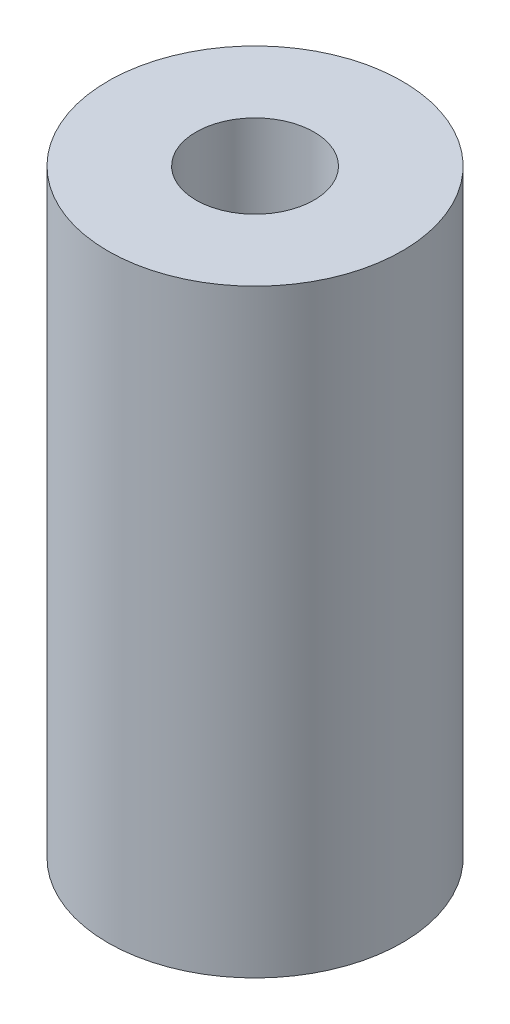
ISO-10303-21;
HEADER;
FILE_DESCRIPTION(('STEP AP214'),'2;1');
FILE_NAME('part.step','',(''),(''),'','','');
FILE_SCHEMA(('AUTOMOTIVE_DESIGN { 1 0 10303 214 1 1 1 1 }'));
ENDSEC;
DATA;
#1=APPLICATION_CONTEXT('core data for automotive mechanical design processes');
#2=APPLICATION_PROTOCOL_DEFINITION('international standard','automotive_design',2000,#1);
#3=PRODUCT_CONTEXT('',#1,'mechanical');
#4=PRODUCT('Part','Part','',(#3));
#5=PRODUCT_RELATED_PRODUCT_CATEGORY('part','',(#4));
#6=PRODUCT_DEFINITION_FORMATION('','',#4);
#7=PRODUCT_DEFINITION_CONTEXT('part definition',#1,'design');
#8=PRODUCT_DEFINITION('design','',#6,#7);
#9=PRODUCT_DEFINITION_SHAPE('','',#8);
#10=(LENGTH_UNIT() NAMED_UNIT(*) SI_UNIT(.MILLI.,.METRE.));
#11=(NAMED_UNIT(*) PLANE_ANGLE_UNIT() SI_UNIT($,.RADIAN.));
#12=(NAMED_UNIT(*) SI_UNIT($,.STERADIAN.) SOLID_ANGLE_UNIT());
#13=UNCERTAINTY_MEASURE_WITH_UNIT(LENGTH_MEASURE(1.E-05),#10,'distance_accuracy_value','');
#14=(GEOMETRIC_REPRESENTATION_CONTEXT(3) GLOBAL_UNCERTAINTY_ASSIGNED_CONTEXT((#13)) GLOBAL_UNIT_ASSIGNED_CONTEXT((#10,
#11,#12)) REPRESENTATION_CONTEXT('',''));
#15=CARTESIAN_POINT('',(0.,0.,0.));
#16=DIRECTION('',(0.,0.,1.));
#17=DIRECTION('',(1.,0.,0.));
#18=AXIS2_PLACEMENT_3D('',#15,#16,#17);
#19=CARTESIAN_POINT('',(0.,34.,0.));
#20=DIRECTION('',(0.,-1.,0.));
#21=DIRECTION('',(0.,0.,-1.));
#22=AXIS2_PLACEMENT_3D('',#19,#20,#21);
#23=CYLINDRICAL_SURFACE('',#22,3.35);
#24=CARTESIAN_POINT('',(0.,15.5,0.));
#25=DIRECTION('',(0.,1.,0.));
#26=DIRECTION('',(0.,0.,1.));
#27=AXIS2_PLACEMENT_3D('',#24,#25,#26);
#28=CIRCLE('',#27,3.35);
#29=CARTESIAN_POINT('',(0.,15.5,3.35));
#30=VERTEX_POINT('',#29);
#31=EDGE_CURVE('E53',#30,#30,#28,.T.);
#32=ORIENTED_EDGE('',*,*,#31,.T.);
#33=EDGE_LOOP('',(#32));
#34=FACE_BOUND('',#33,.T.);
#35=CARTESIAN_POINT('',(0.,0.,0.));
#36=DIRECTION('',(0.,1.,0.));
#37=DIRECTION('',(0.,0.,1.));
#38=AXIS2_PLACEMENT_3D('',#35,#36,#37);
#39=CIRCLE('',#38,3.35);
#40=CARTESIAN_POINT('',(0.,0.,3.35));
#41=VERTEX_POINT('',#40);
#42=EDGE_CURVE('E67',#41,#41,#39,.T.);
#43=ORIENTED_EDGE('',*,*,#42,.F.);
#44=EDGE_LOOP('',(#43));
#45=FACE_BOUND('',#44,.T.);
#46=ADVANCED_FACE('F45',(#34,#45),#23,.F.);
#47=CARTESIAN_POINT('',(0.,34.,0.));
#48=DIRECTION('',(0.,1.,0.));
#49=DIRECTION('',(0.,0.,1.));
#50=AXIS2_PLACEMENT_3D('',#47,#48,#49);
#51=PLANE('',#50);
#52=CARTESIAN_POINT('',(0.,34.,0.));
#53=DIRECTION('',(0.,1.,0.));
#54=DIRECTION('',(0.,0.,1.));
#55=AXIS2_PLACEMENT_3D('',#52,#53,#54);
#56=CIRCLE('',#55,8.35);
#57=CARTESIAN_POINT('',(0.,34.,8.35));
#58=VERTEX_POINT('',#57);
#59=EDGE_CURVE('E57',#58,#58,#56,.T.);
#60=ORIENTED_EDGE('',*,*,#59,.T.);
#61=EDGE_LOOP('',(#60));
#62=FACE_BOUND('',#61,.T.);
#63=CARTESIAN_POINT('',(0.,34.,0.));
#64=DIRECTION('',(0.,1.,0.));
#65=DIRECTION('',(0.,0.,1.));
#66=AXIS2_PLACEMENT_3D('',#63,#64,#65);
#67=CIRCLE('',#66,3.35);
#68=CARTESIAN_POINT('',(0.,34.,3.35));
#69=VERTEX_POINT('',#68);
#70=EDGE_CURVE('E65',#69,#69,#67,.T.);
#71=ORIENTED_EDGE('',*,*,#70,.F.);
#72=EDGE_LOOP('',(#71));
#73=FACE_BOUND('',#72,.T.);
#74=ADVANCED_FACE('F89',(#62,#73),#51,.T.);
#75=CARTESIAN_POINT('',(0.,0.,0.));
#76=DIRECTION('',(0.,1.,0.));
#77=DIRECTION('',(0.,0.,1.));
#78=AXIS2_PLACEMENT_3D('',#75,#76,#77);
#79=PLANE('',#78);
#80=CARTESIAN_POINT('',(0.,0.,0.));
#81=DIRECTION('',(0.,1.,0.));
#82=DIRECTION('',(0.,0.,1.));
#83=AXIS2_PLACEMENT_3D('',#80,#81,#82);
#84=CIRCLE('',#83,8.35);
#85=CARTESIAN_POINT('',(0.,0.,8.35));
#86=VERTEX_POINT('',#85);
#87=EDGE_CURVE('E61',#86,#86,#84,.T.);
#88=ORIENTED_EDGE('',*,*,#87,.F.);
#89=EDGE_LOOP('',(#88));
#90=FACE_BOUND('',#89,.T.);
#91=ORIENTED_EDGE('',*,*,#42,.T.);
#92=EDGE_LOOP('',(#91));
#93=FACE_BOUND('',#92,.T.);
#94=ADVANCED_FACE('F97',(#90,#93),#79,.F.);
#95=CARTESIAN_POINT('',(0.,34.,0.));
#96=DIRECTION('',(0.,-1.,0.));
#97=DIRECTION('',(0.,0.,-1.));
#98=AXIS2_PLACEMENT_3D('',#95,#96,#97);
#99=CYLINDRICAL_SURFACE('',#98,8.35);
#100=ORIENTED_EDGE('',*,*,#59,.F.);
#101=EDGE_LOOP('',(#100));
#102=FACE_BOUND('',#101,.T.);
#103=ORIENTED_EDGE('',*,*,#87,.T.);
#104=EDGE_LOOP('',(#103));
#105=FACE_BOUND('',#104,.T.);
#106=ADVANCED_FACE('F102',(#102,#105),#99,.T.);
#107=CARTESIAN_POINT('',(0.,18.5,0.));
#108=DIRECTION('',(0.,1.,0.));
#109=DIRECTION('',(0.,0.,1.));
#110=AXIS2_PLACEMENT_3D('',#107,#108,#109);
#111=CIRCLE('',#110,3.35);
#112=CARTESIAN_POINT('',(0.,18.5,3.35));
#113=VERTEX_POINT('',#112);
#114=EDGE_CURVE('E11',#113,#113,#111,.F.);
#115=ORIENTED_EDGE('',*,*,#114,.T.);
#116=EDGE_LOOP('',(#115));
#117=FACE_BOUND('',#116,.T.);
#118=ORIENTED_EDGE('',*,*,#70,.T.);
#119=EDGE_LOOP('',(#118));
#120=FACE_BOUND('',#119,.T.);
#121=ADVANCED_FACE('F91',(#117,#120),#23,.F.);
#122=CARTESIAN_POINT('',(0.,16.5,0.));
#123=DIRECTION('',(0.,1.,0.));
#124=DIRECTION('',(0.,0.,1.));
#125=AXIS2_PLACEMENT_3D('',#122,#123,#124);
#126=CYLINDRICAL_SURFACE('',#125,2.35);
#127=CARTESIAN_POINT('',(0.,16.5,0.));
#128=DIRECTION('',(0.,1.,0.));
#129=DIRECTION('',(0.,0.,1.));
#130=AXIS2_PLACEMENT_3D('',#127,#128,#129);
#131=CIRCLE('',#130,2.35);
#132=CARTESIAN_POINT('',(0.,16.5,2.35));
#133=VERTEX_POINT('',#132);
#134=EDGE_CURVE('E70',#133,#133,#131,.T.);
#135=ORIENTED_EDGE('',*,*,#134,.F.);
#136=EDGE_LOOP('',(#135));
#137=FACE_BOUND('',#136,.T.);
#138=CARTESIAN_POINT('',(0.,17.5,0.));
#139=DIRECTION('',(0.,1.,0.));
#140=DIRECTION('',(0.,0.,1.));
#141=AXIS2_PLACEMENT_3D('',#138,#139,#140);
#142=CIRCLE('',#141,2.35);
#143=CARTESIAN_POINT('',(0.,17.5,2.35));
#144=VERTEX_POINT('',#143);
#145=EDGE_CURVE('E75',#144,#144,#142,.T.);
#146=ORIENTED_EDGE('',*,*,#145,.T.);
#147=EDGE_LOOP('',(#146));
#148=FACE_BOUND('',#147,.T.);
#149=ADVANCED_FACE('F79',(#137,#148),#126,.F.);
#150=CARTESIAN_POINT('',(0.,15.5,0.));
#151=DIRECTION('',(0.,-1.,0.));
#152=DIRECTION('',(0.,0.,-1.));
#153=AXIS2_PLACEMENT_3D('',#150,#151,#152);
#154=CONICAL_SURFACE('',#153,3.35,0.785398163397442);
#155=ORIENTED_EDGE('',*,*,#134,.T.);
#156=EDGE_LOOP('',(#155));
#157=FACE_BOUND('',#156,.T.);
#158=ORIENTED_EDGE('',*,*,#31,.F.);
#159=EDGE_LOOP('',(#158));
#160=FACE_BOUND('',#159,.T.);
#161=ADVANCED_FACE('F82',(#157,#160),#154,.F.);
#162=CARTESIAN_POINT('',(0.,17.5,0.));
#163=DIRECTION('',(0.,1.,0.));
#164=DIRECTION('',(0.,0.,1.));
#165=AXIS2_PLACEMENT_3D('',#162,#163,#164);
#166=CONICAL_SURFACE('',#165,2.35,0.785398163397454);
#167=ORIENTED_EDGE('',*,*,#114,.F.);
#168=EDGE_LOOP('',(#167));
#169=FACE_BOUND('',#168,.T.);
#170=ORIENTED_EDGE('',*,*,#145,.F.);
#171=EDGE_LOOP('',(#170));
#172=FACE_BOUND('',#171,.T.);
#173=ADVANCED_FACE('F48',(#169,#172),#166,.F.);
#174=CLOSED_SHELL('',(#46,#74,#94,#106,#121,#149,#161,#173));
#175=MANIFOLD_SOLID_BREP('B2',#174);
#176=ADVANCED_BREP_SHAPE_REPRESENTATION('',(#18,#175),#14);
#177=SHAPE_DEFINITION_REPRESENTATION(#9,#176);
ENDSEC;
END-ISO-10303-21;
